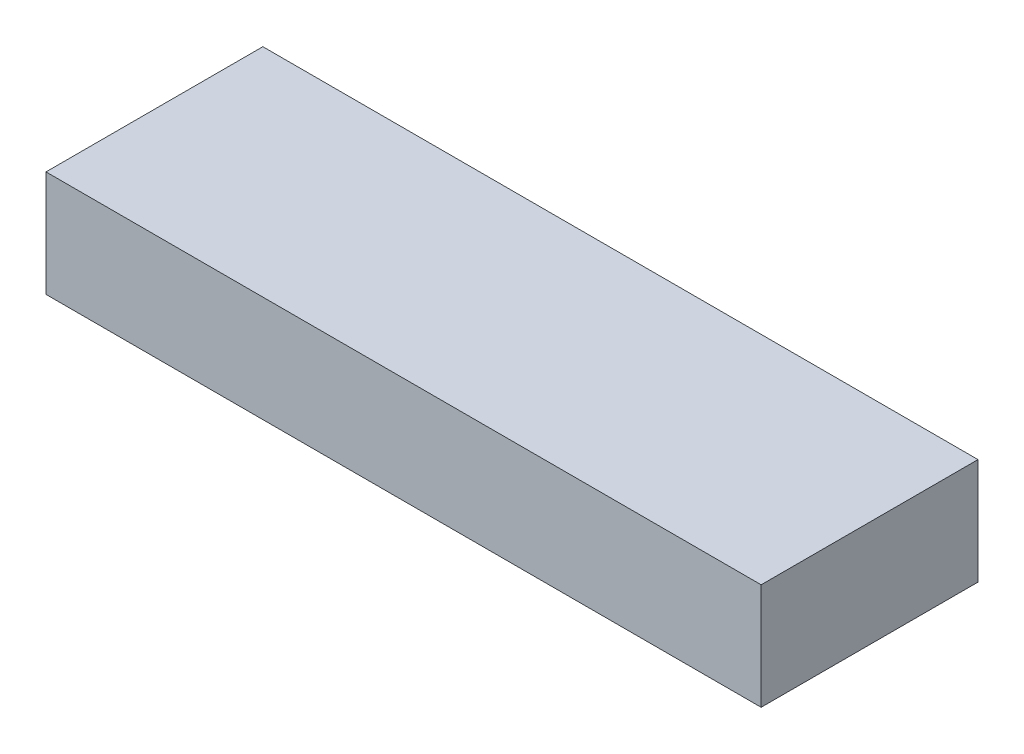
ISO-10303-21;
HEADER;
FILE_DESCRIPTION(('STEP AP214'),'2;1');
FILE_NAME('part.step','',(''),(''),'','','');
FILE_SCHEMA(('AUTOMOTIVE_DESIGN { 1 0 10303 214 1 1 1 1 }'));
ENDSEC;
DATA;
#1=APPLICATION_CONTEXT('core data for automotive mechanical design processes');
#2=APPLICATION_PROTOCOL_DEFINITION('international standard','automotive_design',2000,#1);
#3=PRODUCT_CONTEXT('',#1,'mechanical');
#4=PRODUCT('Part','Part','',(#3));
#5=PRODUCT_RELATED_PRODUCT_CATEGORY('part','',(#4));
#6=PRODUCT_DEFINITION_FORMATION('','',#4);
#7=PRODUCT_DEFINITION_CONTEXT('part definition',#1,'design');
#8=PRODUCT_DEFINITION('design','',#6,#7);
#9=PRODUCT_DEFINITION_SHAPE('','',#8);
#10=(LENGTH_UNIT() NAMED_UNIT(*) SI_UNIT(.MILLI.,.METRE.));
#11=(NAMED_UNIT(*) PLANE_ANGLE_UNIT() SI_UNIT($,.RADIAN.));
#12=(NAMED_UNIT(*) SI_UNIT($,.STERADIAN.) SOLID_ANGLE_UNIT());
#13=UNCERTAINTY_MEASURE_WITH_UNIT(LENGTH_MEASURE(1.E-05),#10,'distance_accuracy_value','');
#14=(GEOMETRIC_REPRESENTATION_CONTEXT(3) GLOBAL_UNCERTAINTY_ASSIGNED_CONTEXT((#13)) GLOBAL_UNIT_ASSIGNED_CONTEXT((#10,
#11,#12)) REPRESENTATION_CONTEXT('',''));
#15=CARTESIAN_POINT('',(0.,0.,0.));
#16=DIRECTION('',(0.,0.,1.));
#17=DIRECTION('',(1.,0.,0.));
#18=AXIS2_PLACEMENT_3D('',#15,#16,#17);
#19=CARTESIAN_POINT('',(77.5,23.,-23.5));
#20=DIRECTION('',(-1.,0.,0.));
#21=DIRECTION('',(0.,0.,1.));
#22=AXIS2_PLACEMENT_3D('',#19,#20,#21);
#23=PLANE('',#22);
#24=DIRECTION('',(0.,0.,-1.));
#25=VECTOR('',#24,1.);
#26=CARTESIAN_POINT('',(77.5,0.,-23.5));
#27=LINE('',#26,#25);
#28=CARTESIAN_POINT('',(77.5,0.,23.5));
#29=VERTEX_POINT('',#28);
#30=CARTESIAN_POINT('',(77.5,0.,-23.5));
#31=VERTEX_POINT('',#30);
#32=EDGE_CURVE('E96',#29,#31,#27,.T.);
#33=ORIENTED_EDGE('',*,*,#32,.T.);
#34=DIRECTION('',(0.,-1.,0.));
#35=VECTOR('',#34,1.);
#36=CARTESIAN_POINT('',(77.5,23.,-23.5));
#37=LINE('',#36,#35);
#38=CARTESIAN_POINT('',(77.5,23.,-23.5));
#39=VERTEX_POINT('',#38);
#40=EDGE_CURVE('E11',#39,#31,#37,.T.);
#41=ORIENTED_EDGE('',*,*,#40,.F.);
#42=DIRECTION('',(0.,0.,-1.));
#43=VECTOR('',#42,1.);
#44=CARTESIAN_POINT('',(77.5,23.,-23.5));
#45=LINE('',#44,#43);
#46=CARTESIAN_POINT('',(77.5,23.,23.5));
#47=VERTEX_POINT('',#46);
#48=EDGE_CURVE('E84',#47,#39,#45,.T.);
#49=ORIENTED_EDGE('',*,*,#48,.F.);
#50=DIRECTION('',(0.,-1.,0.));
#51=VECTOR('',#50,1.);
#52=CARTESIAN_POINT('',(77.5,23.,23.5));
#53=LINE('',#52,#51);
#54=EDGE_CURVE('E92',#47,#29,#53,.T.);
#55=ORIENTED_EDGE('',*,*,#54,.T.);
#56=EDGE_LOOP('',(#33,#41,#49,#55));
#57=FACE_BOUND('',#56,.T.);
#58=ADVANCED_FACE('F33',(#57),#23,.F.);
#59=CARTESIAN_POINT('',(-77.5,23.,-23.5));
#60=DIRECTION('',(0.,0.,1.));
#61=DIRECTION('',(1.,0.,0.));
#62=AXIS2_PLACEMENT_3D('',#59,#60,#61);
#63=PLANE('',#62);
#64=DIRECTION('',(-1.,0.,0.));
#65=VECTOR('',#64,1.);
#66=CARTESIAN_POINT('',(-77.5,0.,-23.5));
#67=LINE('',#66,#65);
#68=CARTESIAN_POINT('',(-77.5,0.,-23.5));
#69=VERTEX_POINT('',#68);
#70=EDGE_CURVE('E88',#31,#69,#67,.T.);
#71=ORIENTED_EDGE('',*,*,#70,.T.);
#72=DIRECTION('',(0.,-1.,0.));
#73=VECTOR('',#72,1.);
#74=CARTESIAN_POINT('',(-77.5,23.,-23.5));
#75=LINE('',#74,#73);
#76=CARTESIAN_POINT('',(-77.5,23.,-23.5));
#77=VERTEX_POINT('',#76);
#78=EDGE_CURVE('E41',#77,#69,#75,.T.);
#79=ORIENTED_EDGE('',*,*,#78,.F.);
#80=DIRECTION('',(-1.,0.,0.));
#81=VECTOR('',#80,1.);
#82=CARTESIAN_POINT('',(-77.5,23.,-23.5));
#83=LINE('',#82,#81);
#84=EDGE_CURVE('E79',#39,#77,#83,.T.);
#85=ORIENTED_EDGE('',*,*,#84,.F.);
#86=ORIENTED_EDGE('',*,*,#40,.T.);
#87=EDGE_LOOP('',(#71,#79,#85,#86));
#88=FACE_BOUND('',#87,.T.);
#89=ADVANCED_FACE('F87',(#88),#63,.F.);
#90=CARTESIAN_POINT('',(-77.5,23.,-23.5));
#91=DIRECTION('',(1.,0.,0.));
#92=DIRECTION('',(0.,0.,-1.));
#93=AXIS2_PLACEMENT_3D('',#90,#91,#92);
#94=PLANE('',#93);
#95=DIRECTION('',(0.,0.,1.));
#96=VECTOR('',#95,1.);
#97=CARTESIAN_POINT('',(-77.5,0.,-23.5));
#98=LINE('',#97,#96);
#99=CARTESIAN_POINT('',(-77.5,0.,23.5));
#100=VERTEX_POINT('',#99);
#101=EDGE_CURVE('E66',#69,#100,#98,.T.);
#102=ORIENTED_EDGE('',*,*,#101,.T.);
#103=DIRECTION('',(0.,-1.,0.));
#104=VECTOR('',#103,1.);
#105=CARTESIAN_POINT('',(-77.5,23.,23.5));
#106=LINE('',#105,#104);
#107=CARTESIAN_POINT('',(-77.5,23.,23.5));
#108=VERTEX_POINT('',#107);
#109=EDGE_CURVE('E89',#108,#100,#106,.T.);
#110=ORIENTED_EDGE('',*,*,#109,.F.);
#111=DIRECTION('',(0.,0.,1.));
#112=VECTOR('',#111,1.);
#113=CARTESIAN_POINT('',(-77.5,23.,-23.5));
#114=LINE('',#113,#112);
#115=EDGE_CURVE('E82',#77,#108,#114,.T.);
#116=ORIENTED_EDGE('',*,*,#115,.F.);
#117=ORIENTED_EDGE('',*,*,#78,.T.);
#118=EDGE_LOOP('',(#102,#110,#116,#117));
#119=FACE_BOUND('',#118,.T.);
#120=ADVANCED_FACE('F90',(#119),#94,.F.);
#121=CARTESIAN_POINT('',(-77.5,23.,23.5));
#122=DIRECTION('',(0.,0.,-1.));
#123=DIRECTION('',(-1.,0.,0.));
#124=AXIS2_PLACEMENT_3D('',#121,#122,#123);
#125=PLANE('',#124);
#126=DIRECTION('',(1.,0.,0.));
#127=VECTOR('',#126,1.);
#128=CARTESIAN_POINT('',(-77.5,0.,23.5));
#129=LINE('',#128,#127);
#130=EDGE_CURVE('E72',#100,#29,#129,.T.);
#131=ORIENTED_EDGE('',*,*,#130,.T.);
#132=ORIENTED_EDGE('',*,*,#54,.F.);
#133=DIRECTION('',(1.,0.,0.));
#134=VECTOR('',#133,1.);
#135=CARTESIAN_POINT('',(-77.5,23.,23.5));
#136=LINE('',#135,#134);
#137=EDGE_CURVE('E49',#108,#47,#136,.T.);
#138=ORIENTED_EDGE('',*,*,#137,.F.);
#139=ORIENTED_EDGE('',*,*,#109,.T.);
#140=EDGE_LOOP('',(#131,#132,#138,#139));
#141=FACE_BOUND('',#140,.T.);
#142=ADVANCED_FACE('F103',(#141),#125,.F.);
#143=CARTESIAN_POINT('',(0.,23.,0.));
#144=DIRECTION('',(0.,1.,0.));
#145=DIRECTION('',(0.,0.,1.));
#146=AXIS2_PLACEMENT_3D('',#143,#144,#145);
#147=PLANE('',#146);
#148=ORIENTED_EDGE('',*,*,#48,.T.);
#149=ORIENTED_EDGE('',*,*,#84,.T.);
#150=ORIENTED_EDGE('',*,*,#115,.T.);
#151=ORIENTED_EDGE('',*,*,#137,.T.);
#152=EDGE_LOOP('',(#148,#149,#150,#151));
#153=FACE_BOUND('',#152,.T.);
#154=ADVANCED_FACE('F80',(#153),#147,.T.);
#155=CARTESIAN_POINT('',(0.,0.,0.));
#156=DIRECTION('',(0.,1.,0.));
#157=DIRECTION('',(0.,0.,1.));
#158=AXIS2_PLACEMENT_3D('',#155,#156,#157);
#159=PLANE('',#158);
#160=ORIENTED_EDGE('',*,*,#32,.F.);
#161=ORIENTED_EDGE('',*,*,#130,.F.);
#162=ORIENTED_EDGE('',*,*,#101,.F.);
#163=ORIENTED_EDGE('',*,*,#70,.F.);
#164=EDGE_LOOP('',(#160,#161,#162,#163));
#165=FACE_BOUND('',#164,.T.);
#166=ADVANCED_FACE('F106',(#165),#159,.F.);
#167=CLOSED_SHELL('',(#58,#89,#120,#142,#154,#166));
#168=MANIFOLD_SOLID_BREP('B2',#167);
#169=ADVANCED_BREP_SHAPE_REPRESENTATION('',(#18,#168),#14);
#170=SHAPE_DEFINITION_REPRESENTATION(#9,#169);
ENDSEC;
END-ISO-10303-21;
